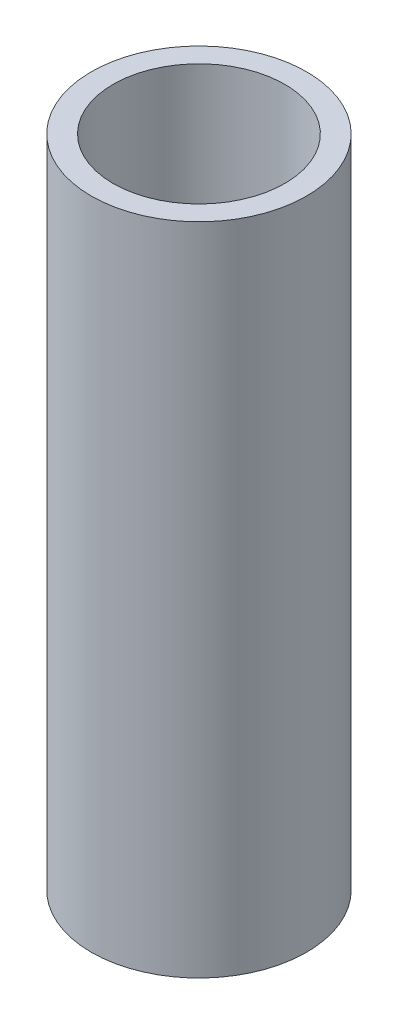
ISO-10303-21;
HEADER;
FILE_DESCRIPTION(('STEP AP214'),'2;1');
FILE_NAME('part.step','',(''),(''),'','','');
FILE_SCHEMA(('AUTOMOTIVE_DESIGN { 1 0 10303 214 1 1 1 1 }'));
ENDSEC;
DATA;
#1=APPLICATION_CONTEXT('core data for automotive mechanical design processes');
#2=APPLICATION_PROTOCOL_DEFINITION('international standard','automotive_design',2000,#1);
#3=PRODUCT_CONTEXT('',#1,'mechanical');
#4=PRODUCT('Part','Part','',(#3));
#5=PRODUCT_RELATED_PRODUCT_CATEGORY('part','',(#4));
#6=PRODUCT_DEFINITION_FORMATION('','',#4);
#7=PRODUCT_DEFINITION_CONTEXT('part definition',#1,'design');
#8=PRODUCT_DEFINITION('design','',#6,#7);
#9=PRODUCT_DEFINITION_SHAPE('','',#8);
#10=(LENGTH_UNIT() NAMED_UNIT(*) SI_UNIT(.MILLI.,.METRE.));
#11=(NAMED_UNIT(*) PLANE_ANGLE_UNIT() SI_UNIT($,.RADIAN.));
#12=(NAMED_UNIT(*) SI_UNIT($,.STERADIAN.) SOLID_ANGLE_UNIT());
#13=UNCERTAINTY_MEASURE_WITH_UNIT(LENGTH_MEASURE(1.E-05),#10,'distance_accuracy_value','');
#14=(GEOMETRIC_REPRESENTATION_CONTEXT(3) GLOBAL_UNCERTAINTY_ASSIGNED_CONTEXT((#13)) GLOBAL_UNIT_ASSIGNED_CONTEXT((#10,
#11,#12)) REPRESENTATION_CONTEXT('',''));
#15=CARTESIAN_POINT('',(0.,0.,0.));
#16=DIRECTION('',(0.,0.,1.));
#17=DIRECTION('',(1.,0.,0.));
#18=AXIS2_PLACEMENT_3D('',#15,#16,#17);
#19=CARTESIAN_POINT('',(0.,101.6,0.));
#20=DIRECTION('',(0.,1.,0.));
#21=DIRECTION('',(0.,0.,1.));
#22=AXIS2_PLACEMENT_3D('',#19,#20,#21);
#23=PLANE('',#22);
#24=CARTESIAN_POINT('',(0.,101.6,0.));
#25=DIRECTION('',(0.,1.,0.));
#26=DIRECTION('',(0.,0.,1.));
#27=AXIS2_PLACEMENT_3D('',#24,#25,#26);
#28=CIRCLE('',#27,16.7005);
#29=CARTESIAN_POINT('',(0.,101.6,16.7005));
#30=VERTEX_POINT('',#29);
#31=EDGE_CURVE('E10',#30,#30,#28,.T.);
#32=ORIENTED_EDGE('',*,*,#31,.T.);
#33=EDGE_LOOP('',(#32));
#34=FACE_BOUND('',#33,.T.);
#35=CARTESIAN_POINT('',(0.,101.6,0.));
#36=DIRECTION('',(0.,1.,0.));
#37=DIRECTION('',(0.,0.,1.));
#38=AXIS2_PLACEMENT_3D('',#35,#36,#37);
#39=CIRCLE('',#38,13.3223);
#40=CARTESIAN_POINT('',(0.,101.6,13.3223));
#41=VERTEX_POINT('',#40);
#42=EDGE_CURVE('E42',#41,#41,#39,.T.);
#43=ORIENTED_EDGE('',*,*,#42,.F.);
#44=EDGE_LOOP('',(#43));
#45=FACE_BOUND('',#44,.T.);
#46=ADVANCED_FACE('F31',(#34,#45),#23,.T.);
#47=CARTESIAN_POINT('',(0.,0.,0.));
#48=DIRECTION('',(0.,1.,0.));
#49=DIRECTION('',(0.,0.,1.));
#50=AXIS2_PLACEMENT_3D('',#47,#48,#49);
#51=PLANE('',#50);
#52=CARTESIAN_POINT('',(0.,0.,0.));
#53=DIRECTION('',(0.,1.,0.));
#54=DIRECTION('',(0.,0.,1.));
#55=AXIS2_PLACEMENT_3D('',#52,#53,#54);
#56=CIRCLE('',#55,16.7005);
#57=CARTESIAN_POINT('',(0.,0.,16.7005));
#58=VERTEX_POINT('',#57);
#59=EDGE_CURVE('E35',#58,#58,#56,.T.);
#60=ORIENTED_EDGE('',*,*,#59,.F.);
#61=EDGE_LOOP('',(#60));
#62=FACE_BOUND('',#61,.T.);
#63=CARTESIAN_POINT('',(0.,0.,0.));
#64=DIRECTION('',(0.,1.,0.));
#65=DIRECTION('',(0.,0.,1.));
#66=AXIS2_PLACEMENT_3D('',#63,#64,#65);
#67=CIRCLE('',#66,13.3223);
#68=CARTESIAN_POINT('',(0.,0.,13.3223));
#69=VERTEX_POINT('',#68);
#70=EDGE_CURVE('E44',#69,#69,#67,.T.);
#71=ORIENTED_EDGE('',*,*,#70,.T.);
#72=EDGE_LOOP('',(#71));
#73=FACE_BOUND('',#72,.T.);
#74=ADVANCED_FACE('F54',(#62,#73),#51,.F.);
#75=CARTESIAN_POINT('',(0.,101.6,0.));
#76=DIRECTION('',(0.,-1.,0.));
#77=DIRECTION('',(0.,0.,-1.));
#78=AXIS2_PLACEMENT_3D('',#75,#76,#77);
#79=CYLINDRICAL_SURFACE('',#78,16.7005);
#80=ORIENTED_EDGE('',*,*,#31,.F.);
#81=EDGE_LOOP('',(#80));
#82=FACE_BOUND('',#81,.T.);
#83=ORIENTED_EDGE('',*,*,#59,.T.);
#84=EDGE_LOOP('',(#83));
#85=FACE_BOUND('',#84,.T.);
#86=ADVANCED_FACE('F33',(#82,#85),#79,.T.);
#87=CARTESIAN_POINT('',(0.,101.6,0.));
#88=DIRECTION('',(0.,-1.,0.));
#89=DIRECTION('',(0.,0.,-1.));
#90=AXIS2_PLACEMENT_3D('',#87,#88,#89);
#91=CYLINDRICAL_SURFACE('',#90,13.3223);
#92=ORIENTED_EDGE('',*,*,#42,.T.);
#93=EDGE_LOOP('',(#92));
#94=FACE_BOUND('',#93,.T.);
#95=ORIENTED_EDGE('',*,*,#70,.F.);
#96=EDGE_LOOP('',(#95));
#97=FACE_BOUND('',#96,.T.);
#98=ADVANCED_FACE('F50',(#94,#97),#91,.F.);
#99=CLOSED_SHELL('',(#46,#74,#86,#98));
#100=MANIFOLD_SOLID_BREP('B2',#99);
#101=ADVANCED_BREP_SHAPE_REPRESENTATION('',(#18,#100),#14);
#102=SHAPE_DEFINITION_REPRESENTATION(#9,#101);
ENDSEC;
END-ISO-10303-21;
